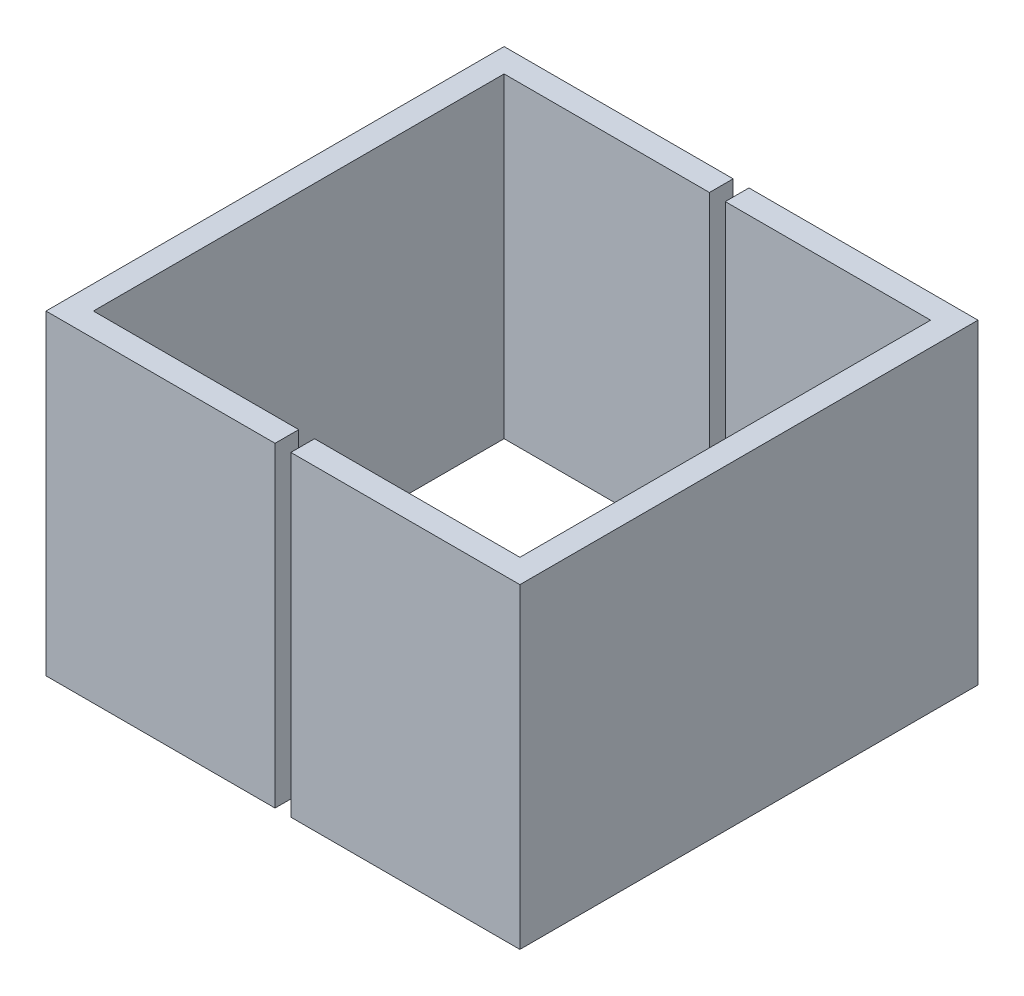
ISO-10303-21;
HEADER;
FILE_DESCRIPTION(('STEP AP214'),'2;1');
FILE_NAME('part.step','',(''),(''),'','','');
FILE_SCHEMA(('AUTOMOTIVE_DESIGN { 1 0 10303 214 1 1 1 1 }'));
ENDSEC;
DATA;
#1=APPLICATION_CONTEXT('core data for automotive mechanical design processes');
#2=APPLICATION_PROTOCOL_DEFINITION('international standard','automotive_design',2000,#1);
#3=PRODUCT_CONTEXT('',#1,'mechanical');
#4=PRODUCT('Part','Part','',(#3));
#5=PRODUCT_RELATED_PRODUCT_CATEGORY('part','',(#4));
#6=PRODUCT_DEFINITION_FORMATION('','',#4);
#7=PRODUCT_DEFINITION_CONTEXT('part definition',#1,'design');
#8=PRODUCT_DEFINITION('design','',#6,#7);
#9=PRODUCT_DEFINITION_SHAPE('','',#8);
#10=(LENGTH_UNIT() NAMED_UNIT(*) SI_UNIT(.MILLI.,.METRE.));
#11=(NAMED_UNIT(*) PLANE_ANGLE_UNIT() SI_UNIT($,.RADIAN.));
#12=(NAMED_UNIT(*) SI_UNIT($,.STERADIAN.) SOLID_ANGLE_UNIT());
#13=UNCERTAINTY_MEASURE_WITH_UNIT(LENGTH_MEASURE(1.E-05),#10,'distance_accuracy_value','');
#14=(GEOMETRIC_REPRESENTATION_CONTEXT(3) GLOBAL_UNCERTAINTY_ASSIGNED_CONTEXT((#13)) GLOBAL_UNIT_ASSIGNED_CONTEXT((#10,
#11,#12)) REPRESENTATION_CONTEXT('',''));
#15=CARTESIAN_POINT('',(0.,0.,0.));
#16=DIRECTION('',(0.,0.,1.));
#17=DIRECTION('',(1.,0.,0.));
#18=AXIS2_PLACEMENT_3D('',#15,#16,#17);
#19=CARTESIAN_POINT('',(0.,20.,0.));
#20=DIRECTION('',(0.,1.,0.));
#21=DIRECTION('',(0.,0.,1.));
#22=AXIS2_PLACEMENT_3D('',#19,#20,#21);
#23=PLANE('',#22);
#24=DIRECTION('',(0.,0.,1.));
#25=VECTOR('',#24,1.);
#26=CARTESIAN_POINT('',(-0.5,20.,-14.5));
#27=LINE('',#26,#25);
#28=CARTESIAN_POINT('',(-0.5,20.,-14.5));
#29=VERTEX_POINT('',#28);
#30=CARTESIAN_POINT('',(-0.5,20.,-13.));
#31=VERTEX_POINT('',#30);
#32=EDGE_CURVE('E12',#29,#31,#27,.T.);
#33=ORIENTED_EDGE('',*,*,#32,.F.);
#34=DIRECTION('',(-1.,0.,0.));
#35=VECTOR('',#34,1.);
#36=CARTESIAN_POINT('',(15.,20.,-14.5));
#37=LINE('',#36,#35);
#38=CARTESIAN_POINT('',(-15.,20.,-14.5));
#39=VERTEX_POINT('',#38);
#40=EDGE_CURVE('E117',#29,#39,#37,.T.);
#41=ORIENTED_EDGE('',*,*,#40,.T.);
#42=DIRECTION('',(0.,0.,1.));
#43=VECTOR('',#42,1.);
#44=CARTESIAN_POINT('',(-15.,20.,14.5));
#45=LINE('',#44,#43);
#46=CARTESIAN_POINT('',(-15.,20.,14.5));
#47=VERTEX_POINT('',#46);
#48=EDGE_CURVE('E157',#39,#47,#45,.T.);
#49=ORIENTED_EDGE('',*,*,#48,.T.);
#50=DIRECTION('',(1.,0.,0.));
#51=VECTOR('',#50,1.);
#52=CARTESIAN_POINT('',(15.,20.,14.5));
#53=LINE('',#52,#51);
#54=CARTESIAN_POINT('',(-0.5,20.,14.5));
#55=VERTEX_POINT('',#54);
#56=EDGE_CURVE('E108',#47,#55,#53,.T.);
#57=ORIENTED_EDGE('',*,*,#56,.T.);
#58=CARTESIAN_POINT('',(-0.5,20.,13.));
#59=VERTEX_POINT('',#58);
#60=EDGE_CURVE('E54',#59,#55,#27,.T.);
#61=ORIENTED_EDGE('',*,*,#60,.F.);
#62=DIRECTION('',(1.,0.,0.));
#63=VECTOR('',#62,1.);
#64=CARTESIAN_POINT('',(13.5,20.,13.));
#65=LINE('',#64,#63);
#66=CARTESIAN_POINT('',(-13.5,20.,13.));
#67=VERTEX_POINT('',#66);
#68=EDGE_CURVE('E137',#67,#59,#65,.T.);
#69=ORIENTED_EDGE('',*,*,#68,.F.);
#70=DIRECTION('',(0.,0.,1.));
#71=VECTOR('',#70,1.);
#72=CARTESIAN_POINT('',(-13.5,20.,13.));
#73=LINE('',#72,#71);
#74=CARTESIAN_POINT('',(-13.5,20.,-13.));
#75=VERTEX_POINT('',#74);
#76=EDGE_CURVE('E151',#75,#67,#73,.T.);
#77=ORIENTED_EDGE('',*,*,#76,.F.);
#78=DIRECTION('',(-1.,0.,0.));
#79=VECTOR('',#78,1.);
#80=CARTESIAN_POINT('',(13.5,20.,-13.));
#81=LINE('',#80,#79);
#82=EDGE_CURVE('E123',#31,#75,#81,.T.);
#83=ORIENTED_EDGE('',*,*,#82,.F.);
#84=EDGE_LOOP('',(#33,#41,#49,#57,#61,#69,#77,#83));
#85=FACE_BOUND('',#84,.T.);
#86=ADVANCED_FACE('F43',(#85),#23,.T.);
#87=CARTESIAN_POINT('',(0.,0.,0.));
#88=DIRECTION('',(0.,1.,0.));
#89=DIRECTION('',(0.,0.,1.));
#90=AXIS2_PLACEMENT_3D('',#87,#88,#89);
#91=PLANE('',#90);
#92=DIRECTION('',(-1.,0.,0.));
#93=VECTOR('',#92,1.);
#94=CARTESIAN_POINT('',(15.,0.,-14.5));
#95=LINE('',#94,#93);
#96=CARTESIAN_POINT('',(-0.5,0.,-14.5));
#97=VERTEX_POINT('',#96);
#98=CARTESIAN_POINT('',(-15.,0.,-14.5));
#99=VERTEX_POINT('',#98);
#100=EDGE_CURVE('E115',#97,#99,#95,.T.);
#101=ORIENTED_EDGE('',*,*,#100,.F.);
#102=DIRECTION('',(0.,0.,1.));
#103=VECTOR('',#102,1.);
#104=CARTESIAN_POINT('',(-0.5,0.,-14.5));
#105=LINE('',#104,#103);
#106=CARTESIAN_POINT('',(-0.5,0.,-13.));
#107=VERTEX_POINT('',#106);
#108=EDGE_CURVE('E101',#97,#107,#105,.T.);
#109=ORIENTED_EDGE('',*,*,#108,.T.);
#110=DIRECTION('',(-1.,0.,0.));
#111=VECTOR('',#110,1.);
#112=CARTESIAN_POINT('',(13.5,0.,-13.));
#113=LINE('',#112,#111);
#114=CARTESIAN_POINT('',(-13.5,0.,-13.));
#115=VERTEX_POINT('',#114);
#116=EDGE_CURVE('E46',#107,#115,#113,.T.);
#117=ORIENTED_EDGE('',*,*,#116,.T.);
#118=DIRECTION('',(0.,0.,1.));
#119=VECTOR('',#118,1.);
#120=CARTESIAN_POINT('',(-13.5,0.,13.));
#121=LINE('',#120,#119);
#122=CARTESIAN_POINT('',(-13.5,0.,13.));
#123=VERTEX_POINT('',#122);
#124=EDGE_CURVE('E141',#115,#123,#121,.T.);
#125=ORIENTED_EDGE('',*,*,#124,.T.);
#126=DIRECTION('',(1.,0.,0.));
#127=VECTOR('',#126,1.);
#128=CARTESIAN_POINT('',(13.5,0.,13.));
#129=LINE('',#128,#127);
#130=CARTESIAN_POINT('',(-0.5,0.,13.));
#131=VERTEX_POINT('',#130);
#132=EDGE_CURVE('E139',#123,#131,#129,.T.);
#133=ORIENTED_EDGE('',*,*,#132,.T.);
#134=CARTESIAN_POINT('',(-0.5,0.,14.5));
#135=VERTEX_POINT('',#134);
#136=EDGE_CURVE('E110',#131,#135,#105,.T.);
#137=ORIENTED_EDGE('',*,*,#136,.T.);
#138=DIRECTION('',(1.,0.,0.));
#139=VECTOR('',#138,1.);
#140=CARTESIAN_POINT('',(15.,0.,14.5));
#141=LINE('',#140,#139);
#142=CARTESIAN_POINT('',(-15.,0.,14.5));
#143=VERTEX_POINT('',#142);
#144=EDGE_CURVE('E134',#143,#135,#141,.T.);
#145=ORIENTED_EDGE('',*,*,#144,.F.);
#146=DIRECTION('',(0.,0.,1.));
#147=VECTOR('',#146,1.);
#148=CARTESIAN_POINT('',(-15.,0.,14.5));
#149=LINE('',#148,#147);
#150=EDGE_CURVE('E122',#99,#143,#149,.T.);
#151=ORIENTED_EDGE('',*,*,#150,.F.);
#152=EDGE_LOOP('',(#101,#109,#117,#125,#133,#137,#145,#151));
#153=FACE_BOUND('',#152,.T.);
#154=ADVANCED_FACE('F120',(#153),#91,.F.);
#155=CARTESIAN_POINT('',(15.,20.,14.5));
#156=DIRECTION('',(0.,0.,-1.));
#157=DIRECTION('',(-1.,0.,0.));
#158=AXIS2_PLACEMENT_3D('',#155,#156,#157);
#159=PLANE('',#158);
#160=ORIENTED_EDGE('',*,*,#144,.T.);
#161=DIRECTION('',(0.,1.,0.));
#162=VECTOR('',#161,1.);
#163=CARTESIAN_POINT('',(-0.5,0.,14.5));
#164=LINE('',#163,#162);
#165=EDGE_CURVE('E129',#135,#55,#164,.T.);
#166=ORIENTED_EDGE('',*,*,#165,.T.);
#167=ORIENTED_EDGE('',*,*,#56,.F.);
#168=DIRECTION('',(0.,-1.,0.));
#169=VECTOR('',#168,1.);
#170=CARTESIAN_POINT('',(-15.,20.,14.5));
#171=LINE('',#170,#169);
#172=EDGE_CURVE('E124',#47,#143,#171,.T.);
#173=ORIENTED_EDGE('',*,*,#172,.T.);
#174=EDGE_LOOP('',(#160,#166,#167,#173));
#175=FACE_BOUND('',#174,.T.);
#176=ADVANCED_FACE('F185',(#175),#159,.F.);
#177=CARTESIAN_POINT('',(15.,20.,-14.5));
#178=DIRECTION('',(0.,0.,1.));
#179=DIRECTION('',(1.,0.,0.));
#180=AXIS2_PLACEMENT_3D('',#177,#178,#179);
#181=PLANE('',#180);
#182=ORIENTED_EDGE('',*,*,#40,.F.);
#183=DIRECTION('',(0.,1.,0.));
#184=VECTOR('',#183,1.);
#185=CARTESIAN_POINT('',(-0.5,0.,-14.5));
#186=LINE('',#185,#184);
#187=EDGE_CURVE('E52',#97,#29,#186,.T.);
#188=ORIENTED_EDGE('',*,*,#187,.F.);
#189=ORIENTED_EDGE('',*,*,#100,.T.);
#190=DIRECTION('',(0.,-1.,0.));
#191=VECTOR('',#190,1.);
#192=CARTESIAN_POINT('',(-15.,20.,-14.5));
#193=LINE('',#192,#191);
#194=EDGE_CURVE('E154',#39,#99,#193,.T.);
#195=ORIENTED_EDGE('',*,*,#194,.F.);
#196=EDGE_LOOP('',(#182,#188,#189,#195));
#197=FACE_BOUND('',#196,.T.);
#198=ADVANCED_FACE('F113',(#197),#181,.F.);
#199=CARTESIAN_POINT('',(13.5,20.,-13.));
#200=DIRECTION('',(0.,0.,1.));
#201=DIRECTION('',(1.,0.,0.));
#202=AXIS2_PLACEMENT_3D('',#199,#200,#201);
#203=PLANE('',#202);
#204=DIRECTION('',(0.,-1.,0.));
#205=VECTOR('',#204,1.);
#206=CARTESIAN_POINT('',(-0.5,20.,-13.));
#207=LINE('',#206,#205);
#208=EDGE_CURVE('E104',#31,#107,#207,.T.);
#209=ORIENTED_EDGE('',*,*,#208,.F.);
#210=ORIENTED_EDGE('',*,*,#82,.T.);
#211=DIRECTION('',(0.,-1.,0.));
#212=VECTOR('',#211,1.);
#213=CARTESIAN_POINT('',(-13.5,20.,-13.));
#214=LINE('',#213,#212);
#215=EDGE_CURVE('E126',#75,#115,#214,.T.);
#216=ORIENTED_EDGE('',*,*,#215,.T.);
#217=ORIENTED_EDGE('',*,*,#116,.F.);
#218=EDGE_LOOP('',(#209,#210,#216,#217));
#219=FACE_BOUND('',#218,.T.);
#220=ADVANCED_FACE('F169',(#219),#203,.T.);
#221=CARTESIAN_POINT('',(13.5,20.,13.));
#222=DIRECTION('',(0.,0.,-1.));
#223=DIRECTION('',(-1.,0.,0.));
#224=AXIS2_PLACEMENT_3D('',#221,#222,#223);
#225=PLANE('',#224);
#226=DIRECTION('',(0.,1.,0.));
#227=VECTOR('',#226,1.);
#228=CARTESIAN_POINT('',(-0.5,20.,13.));
#229=LINE('',#228,#227);
#230=EDGE_CURVE('E176',#131,#59,#229,.T.);
#231=ORIENTED_EDGE('',*,*,#230,.F.);
#232=ORIENTED_EDGE('',*,*,#132,.F.);
#233=DIRECTION('',(0.,-1.,0.));
#234=VECTOR('',#233,1.);
#235=CARTESIAN_POINT('',(-13.5,20.,13.));
#236=LINE('',#235,#234);
#237=EDGE_CURVE('E149',#67,#123,#236,.T.);
#238=ORIENTED_EDGE('',*,*,#237,.F.);
#239=ORIENTED_EDGE('',*,*,#68,.T.);
#240=EDGE_LOOP('',(#231,#232,#238,#239));
#241=FACE_BOUND('',#240,.T.);
#242=ADVANCED_FACE('F178',(#241),#225,.T.);
#243=CARTESIAN_POINT('',(-15.,20.,14.5));
#244=DIRECTION('',(1.,0.,0.));
#245=DIRECTION('',(0.,0.,-1.));
#246=AXIS2_PLACEMENT_3D('',#243,#244,#245);
#247=PLANE('',#246);
#248=ORIENTED_EDGE('',*,*,#150,.T.);
#249=ORIENTED_EDGE('',*,*,#172,.F.);
#250=ORIENTED_EDGE('',*,*,#48,.F.);
#251=ORIENTED_EDGE('',*,*,#194,.T.);
#252=EDGE_LOOP('',(#248,#249,#250,#251));
#253=FACE_BOUND('',#252,.T.);
#254=ADVANCED_FACE('F183',(#253),#247,.F.);
#255=CARTESIAN_POINT('',(-13.5,20.,13.));
#256=DIRECTION('',(1.,0.,0.));
#257=DIRECTION('',(0.,0.,-1.));
#258=AXIS2_PLACEMENT_3D('',#255,#256,#257);
#259=PLANE('',#258);
#260=ORIENTED_EDGE('',*,*,#124,.F.);
#261=ORIENTED_EDGE('',*,*,#215,.F.);
#262=ORIENTED_EDGE('',*,*,#76,.T.);
#263=ORIENTED_EDGE('',*,*,#237,.T.);
#264=EDGE_LOOP('',(#260,#261,#262,#263));
#265=FACE_BOUND('',#264,.T.);
#266=ADVANCED_FACE('F173',(#265),#259,.T.);
#267=CARTESIAN_POINT('',(-0.5,0.,-14.5));
#268=DIRECTION('',(-1.,0.,0.));
#269=DIRECTION('',(0.,0.,1.));
#270=AXIS2_PLACEMENT_3D('',#267,#268,#269);
#271=PLANE('',#270);
#272=ORIENTED_EDGE('',*,*,#230,.T.);
#273=ORIENTED_EDGE('',*,*,#60,.T.);
#274=ORIENTED_EDGE('',*,*,#165,.F.);
#275=ORIENTED_EDGE('',*,*,#136,.F.);
#276=EDGE_LOOP('',(#272,#273,#274,#275));
#277=FACE_BOUND('',#276,.T.);
#278=ADVANCED_FACE('F187',(#277),#271,.F.);
#279=ORIENTED_EDGE('',*,*,#208,.T.);
#280=ORIENTED_EDGE('',*,*,#108,.F.);
#281=ORIENTED_EDGE('',*,*,#187,.T.);
#282=ORIENTED_EDGE('',*,*,#32,.T.);
#283=EDGE_LOOP('',(#279,#280,#281,#282));
#284=FACE_BOUND('',#283,.T.);
#285=ADVANCED_FACE('F103',(#284),#271,.F.);
#286=CLOSED_SHELL('',(#86,#154,#176,#198,#220,#242,#254,#266,#278,#285));
#287=MANIFOLD_SOLID_BREP('B2',#286);
#288=CARTESIAN_POINT('',(15.,20.,14.5));
#289=DIRECTION('',(-1.,0.,0.));
#290=DIRECTION('',(0.,0.,1.));
#291=AXIS2_PLACEMENT_3D('',#288,#289,#290);
#292=PLANE('',#291);
#293=DIRECTION('',(0.,0.,-1.));
#294=VECTOR('',#293,1.);
#295=CARTESIAN_POINT('',(15.,0.,14.5));
#296=LINE('',#295,#294);
#297=CARTESIAN_POINT('',(15.,0.,14.5));
#298=VERTEX_POINT('',#297);
#299=CARTESIAN_POINT('',(15.,0.,-14.5));
#300=VERTEX_POINT('',#299);
#301=EDGE_CURVE('E349',#298,#300,#296,.T.);
#302=ORIENTED_EDGE('',*,*,#301,.T.);
#303=DIRECTION('',(0.,-1.,0.));
#304=VECTOR('',#303,1.);
#305=CARTESIAN_POINT('',(15.,20.,-14.5));
#306=LINE('',#305,#304);
#307=CARTESIAN_POINT('',(15.,20.,-14.5));
#308=VERTEX_POINT('',#307);
#309=EDGE_CURVE('E363',#308,#300,#306,.T.);
#310=ORIENTED_EDGE('',*,*,#309,.F.);
#311=DIRECTION('',(0.,0.,-1.));
#312=VECTOR('',#311,1.);
#313=CARTESIAN_POINT('',(15.,20.,14.5));
#314=LINE('',#313,#312);
#315=CARTESIAN_POINT('',(15.,20.,14.5));
#316=VERTEX_POINT('',#315);
#317=EDGE_CURVE('E368',#316,#308,#314,.T.);
#318=ORIENTED_EDGE('',*,*,#317,.F.);
#319=DIRECTION('',(0.,-1.,0.));
#320=VECTOR('',#319,1.);
#321=CARTESIAN_POINT('',(15.,20.,14.5));
#322=LINE('',#321,#320);
#323=EDGE_CURVE('E276',#316,#298,#322,.T.);
#324=ORIENTED_EDGE('',*,*,#323,.T.);
#325=EDGE_LOOP('',(#302,#310,#318,#324));
#326=FACE_BOUND('',#325,.T.);
#327=ADVANCED_FACE('F268',(#326),#292,.F.);
#328=CARTESIAN_POINT('',(13.5,20.,13.));
#329=DIRECTION('',(-1.,0.,0.));
#330=DIRECTION('',(0.,0.,1.));
#331=AXIS2_PLACEMENT_3D('',#328,#329,#330);
#332=PLANE('',#331);
#333=DIRECTION('',(0.,0.,-1.));
#334=VECTOR('',#333,1.);
#335=CARTESIAN_POINT('',(13.5,0.,13.));
#336=LINE('',#335,#334);
#337=CARTESIAN_POINT('',(13.5,0.,13.));
#338=VERTEX_POINT('',#337);
#339=CARTESIAN_POINT('',(13.5,0.,-13.));
#340=VERTEX_POINT('',#339);
#341=EDGE_CURVE('E383',#338,#340,#336,.T.);
#342=ORIENTED_EDGE('',*,*,#341,.F.);
#343=DIRECTION('',(0.,-1.,0.));
#344=VECTOR('',#343,1.);
#345=CARTESIAN_POINT('',(13.5,20.,13.));
#346=LINE('',#345,#344);
#347=CARTESIAN_POINT('',(13.5,20.,13.));
#348=VERTEX_POINT('',#347);
#349=EDGE_CURVE('E355',#348,#338,#346,.T.);
#350=ORIENTED_EDGE('',*,*,#349,.F.);
#351=DIRECTION('',(0.,0.,-1.));
#352=VECTOR('',#351,1.);
#353=CARTESIAN_POINT('',(13.5,20.,13.));
#354=LINE('',#353,#352);
#355=CARTESIAN_POINT('',(13.5,20.,-13.));
#356=VERTEX_POINT('',#355);
#357=EDGE_CURVE('E379',#348,#356,#354,.T.);
#358=ORIENTED_EDGE('',*,*,#357,.T.);
#359=DIRECTION('',(0.,-1.,0.));
#360=VECTOR('',#359,1.);
#361=CARTESIAN_POINT('',(13.5,20.,-13.));
#362=LINE('',#361,#360);
#363=EDGE_CURVE('E350',#356,#340,#362,.T.);
#364=ORIENTED_EDGE('',*,*,#363,.T.);
#365=EDGE_LOOP('',(#342,#350,#358,#364));
#366=FACE_BOUND('',#365,.T.);
#367=ADVANCED_FACE('F413',(#366),#332,.T.);
#368=CARTESIAN_POINT('',(15.,20.,-14.5));
#369=DIRECTION('',(0.,0.,1.));
#370=DIRECTION('',(1.,0.,0.));
#371=AXIS2_PLACEMENT_3D('',#368,#369,#370);
#372=PLANE('',#371);
#373=DIRECTION('',(-1.,0.,0.));
#374=VECTOR('',#373,1.);
#375=CARTESIAN_POINT('',(15.,0.,-14.5));
#376=LINE('',#375,#374);
#377=CARTESIAN_POINT('',(0.5,0.,-14.5));
#378=VERTEX_POINT('',#377);
#379=EDGE_CURVE('E352',#300,#378,#376,.T.);
#380=ORIENTED_EDGE('',*,*,#379,.T.);
#381=DIRECTION('',(0.,1.,0.));
#382=VECTOR('',#381,1.);
#383=CARTESIAN_POINT('',(0.5,0.,-14.5));
#384=LINE('',#383,#382);
#385=CARTESIAN_POINT('',(0.5,20.,-14.5));
#386=VERTEX_POINT('',#385);
#387=EDGE_CURVE('E344',#378,#386,#384,.T.);
#388=ORIENTED_EDGE('',*,*,#387,.T.);
#389=DIRECTION('',(-1.,0.,0.));
#390=VECTOR('',#389,1.);
#391=CARTESIAN_POINT('',(15.,20.,-14.5));
#392=LINE('',#391,#390);
#393=EDGE_CURVE('E358',#308,#386,#392,.T.);
#394=ORIENTED_EDGE('',*,*,#393,.F.);
#395=ORIENTED_EDGE('',*,*,#309,.T.);
#396=EDGE_LOOP('',(#380,#388,#394,#395));
#397=FACE_BOUND('',#396,.T.);
#398=ADVANCED_FACE('F400',(#397),#372,.F.);
#399=CARTESIAN_POINT('',(13.5,20.,-13.));
#400=DIRECTION('',(0.,0.,1.));
#401=DIRECTION('',(1.,0.,0.));
#402=AXIS2_PLACEMENT_3D('',#399,#400,#401);
#403=PLANE('',#402);
#404=DIRECTION('',(0.,1.,0.));
#405=VECTOR('',#404,1.);
#406=CARTESIAN_POINT('',(0.5,20.,-13.));
#407=LINE('',#406,#405);
#408=CARTESIAN_POINT('',(0.5,0.,-13.));
#409=VERTEX_POINT('',#408);
#410=CARTESIAN_POINT('',(0.5,20.,-13.));
#411=VERTEX_POINT('',#410);
#412=EDGE_CURVE('E386',#409,#411,#407,.T.);
#413=ORIENTED_EDGE('',*,*,#412,.F.);
#414=DIRECTION('',(-1.,0.,0.));
#415=VECTOR('',#414,1.);
#416=CARTESIAN_POINT('',(13.5,0.,-13.));
#417=LINE('',#416,#415);
#418=EDGE_CURVE('E380',#340,#409,#417,.T.);
#419=ORIENTED_EDGE('',*,*,#418,.F.);
#420=ORIENTED_EDGE('',*,*,#363,.F.);
#421=DIRECTION('',(-1.,0.,0.));
#422=VECTOR('',#421,1.);
#423=CARTESIAN_POINT('',(13.5,20.,-13.));
#424=LINE('',#423,#422);
#425=EDGE_CURVE('E388',#356,#411,#424,.T.);
#426=ORIENTED_EDGE('',*,*,#425,.T.);
#427=EDGE_LOOP('',(#413,#419,#420,#426));
#428=FACE_BOUND('',#427,.T.);
#429=ADVANCED_FACE('F420',(#428),#403,.T.);
#430=CARTESIAN_POINT('',(13.5,20.,13.));
#431=DIRECTION('',(0.,0.,-1.));
#432=DIRECTION('',(-1.,0.,0.));
#433=AXIS2_PLACEMENT_3D('',#430,#431,#432);
#434=PLANE('',#433);
#435=DIRECTION('',(0.,-1.,0.));
#436=VECTOR('',#435,1.);
#437=CARTESIAN_POINT('',(0.5,20.,13.));
#438=LINE('',#437,#436);
#439=CARTESIAN_POINT('',(0.5,20.,13.));
#440=VERTEX_POINT('',#439);
#441=CARTESIAN_POINT('',(0.5,0.,13.));
#442=VERTEX_POINT('',#441);
#443=EDGE_CURVE('E41',#440,#442,#438,.T.);
#444=ORIENTED_EDGE('',*,*,#443,.F.);
#445=DIRECTION('',(1.,0.,0.));
#446=VECTOR('',#445,1.);
#447=CARTESIAN_POINT('',(13.5,20.,13.));
#448=LINE('',#447,#446);
#449=EDGE_CURVE('E376',#440,#348,#448,.T.);
#450=ORIENTED_EDGE('',*,*,#449,.T.);
#451=ORIENTED_EDGE('',*,*,#349,.T.);
#452=DIRECTION('',(1.,0.,0.));
#453=VECTOR('',#452,1.);
#454=CARTESIAN_POINT('',(13.5,0.,13.));
#455=LINE('',#454,#453);
#456=EDGE_CURVE('E377',#442,#338,#455,.T.);
#457=ORIENTED_EDGE('',*,*,#456,.F.);
#458=EDGE_LOOP('',(#444,#450,#451,#457));
#459=FACE_BOUND('',#458,.T.);
#460=ADVANCED_FACE('F424',(#459),#434,.T.);
#461=CARTESIAN_POINT('',(15.,20.,14.5));
#462=DIRECTION('',(0.,0.,-1.));
#463=DIRECTION('',(-1.,0.,0.));
#464=AXIS2_PLACEMENT_3D('',#461,#462,#463);
#465=PLANE('',#464);
#466=DIRECTION('',(1.,0.,0.));
#467=VECTOR('',#466,1.);
#468=CARTESIAN_POINT('',(15.,20.,14.5));
#469=LINE('',#468,#467);
#470=CARTESIAN_POINT('',(0.5,20.,14.5));
#471=VERTEX_POINT('',#470);
#472=EDGE_CURVE('E343',#471,#316,#469,.T.);
#473=ORIENTED_EDGE('',*,*,#472,.F.);
#474=DIRECTION('',(0.,1.,0.));
#475=VECTOR('',#474,1.);
#476=CARTESIAN_POINT('',(0.5,0.,14.5));
#477=LINE('',#476,#475);
#478=CARTESIAN_POINT('',(0.5,0.,14.5));
#479=VERTEX_POINT('',#478);
#480=EDGE_CURVE('E333',#479,#471,#477,.T.);
#481=ORIENTED_EDGE('',*,*,#480,.F.);
#482=DIRECTION('',(1.,0.,0.));
#483=VECTOR('',#482,1.);
#484=CARTESIAN_POINT('',(15.,0.,14.5));
#485=LINE('',#484,#483);
#486=EDGE_CURVE('E341',#479,#298,#485,.T.);
#487=ORIENTED_EDGE('',*,*,#486,.T.);
#488=ORIENTED_EDGE('',*,*,#323,.F.);
#489=EDGE_LOOP('',(#473,#481,#487,#488));
#490=FACE_BOUND('',#489,.T.);
#491=ADVANCED_FACE('F270',(#490),#465,.F.);
#492=CARTESIAN_POINT('',(0.,0.,0.));
#493=DIRECTION('',(0.,1.,0.));
#494=DIRECTION('',(0.,0.,1.));
#495=AXIS2_PLACEMENT_3D('',#492,#493,#494);
#496=PLANE('',#495);
#497=ORIENTED_EDGE('',*,*,#486,.F.);
#498=DIRECTION('',(0.,0.,-1.));
#499=VECTOR('',#498,1.);
#500=CARTESIAN_POINT('',(0.5,0.,-14.5));
#501=LINE('',#500,#499);
#502=EDGE_CURVE('E330',#479,#442,#501,.T.);
#503=ORIENTED_EDGE('',*,*,#502,.T.);
#504=ORIENTED_EDGE('',*,*,#456,.T.);
#505=ORIENTED_EDGE('',*,*,#341,.T.);
#506=ORIENTED_EDGE('',*,*,#418,.T.);
#507=EDGE_CURVE('E283',#409,#378,#501,.T.);
#508=ORIENTED_EDGE('',*,*,#507,.T.);
#509=ORIENTED_EDGE('',*,*,#379,.F.);
#510=ORIENTED_EDGE('',*,*,#301,.F.);
#511=EDGE_LOOP('',(#497,#503,#504,#505,#506,#508,#509,#510));
#512=FACE_BOUND('',#511,.T.);
#513=ADVANCED_FACE('F347',(#512),#496,.F.);
#514=CARTESIAN_POINT('',(0.,20.,0.));
#515=DIRECTION('',(0.,1.,0.));
#516=DIRECTION('',(0.,0.,1.));
#517=AXIS2_PLACEMENT_3D('',#514,#515,#516);
#518=PLANE('',#517);
#519=DIRECTION('',(0.,0.,-1.));
#520=VECTOR('',#519,1.);
#521=CARTESIAN_POINT('',(0.5,20.,-14.5));
#522=LINE('',#521,#520);
#523=EDGE_CURVE('E290',#471,#440,#522,.T.);
#524=ORIENTED_EDGE('',*,*,#523,.F.);
#525=ORIENTED_EDGE('',*,*,#472,.T.);
#526=ORIENTED_EDGE('',*,*,#317,.T.);
#527=ORIENTED_EDGE('',*,*,#393,.T.);
#528=EDGE_CURVE('E395',#411,#386,#522,.T.);
#529=ORIENTED_EDGE('',*,*,#528,.F.);
#530=ORIENTED_EDGE('',*,*,#425,.F.);
#531=ORIENTED_EDGE('',*,*,#357,.F.);
#532=ORIENTED_EDGE('',*,*,#449,.F.);
#533=EDGE_LOOP('',(#524,#525,#526,#527,#529,#530,#531,#532));
#534=FACE_BOUND('',#533,.T.);
#535=ADVANCED_FACE('F401',(#534),#518,.T.);
#536=CARTESIAN_POINT('',(0.5,0.,-14.5));
#537=DIRECTION('',(1.,0.,0.));
#538=DIRECTION('',(0.,0.,-1.));
#539=AXIS2_PLACEMENT_3D('',#536,#537,#538);
#540=PLANE('',#539);
#541=ORIENTED_EDGE('',*,*,#443,.T.);
#542=ORIENTED_EDGE('',*,*,#502,.F.);
#543=ORIENTED_EDGE('',*,*,#480,.T.);
#544=ORIENTED_EDGE('',*,*,#523,.T.);
#545=EDGE_LOOP('',(#541,#542,#543,#544));
#546=FACE_BOUND('',#545,.T.);
#547=ADVANCED_FACE('F332',(#546),#540,.F.);
#548=ORIENTED_EDGE('',*,*,#412,.T.);
#549=ORIENTED_EDGE('',*,*,#528,.T.);
#550=ORIENTED_EDGE('',*,*,#387,.F.);
#551=ORIENTED_EDGE('',*,*,#507,.F.);
#552=EDGE_LOOP('',(#548,#549,#550,#551));
#553=FACE_BOUND('',#552,.T.);
#554=ADVANCED_FACE('F397',(#553),#540,.F.);
#555=CLOSED_SHELL('',(#327,#367,#398,#429,#460,#491,#513,#535,#547,#554));
#556=MANIFOLD_SOLID_BREP('B6',#555);
#557=ADVANCED_BREP_SHAPE_REPRESENTATION('',(#18,#287,#556),#14);
#558=SHAPE_DEFINITION_REPRESENTATION(#9,#557);
ENDSEC;
END-ISO-10303-21;
